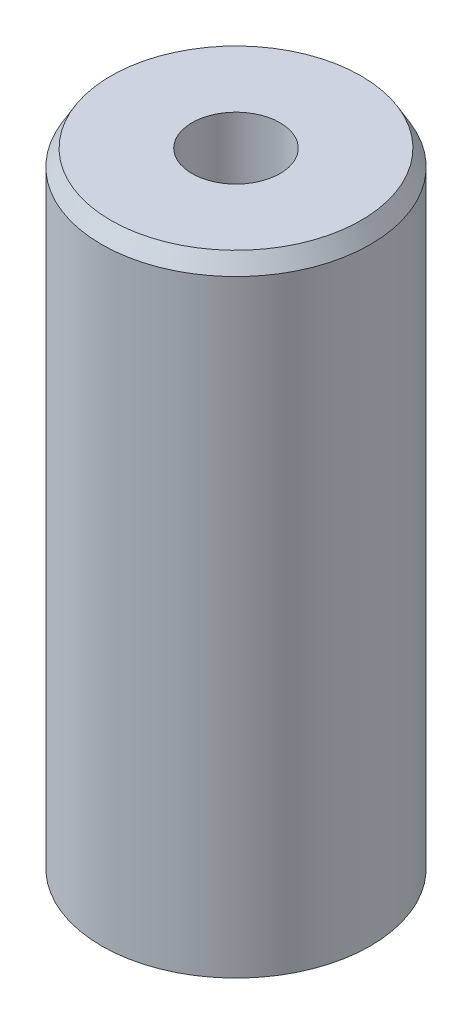
ISO-10303-21;
HEADER;
FILE_DESCRIPTION(('STEP AP214'),'2;1');
FILE_NAME('part.step','',(''),(''),'','','');
FILE_SCHEMA(('AUTOMOTIVE_DESIGN { 1 0 10303 214 1 1 1 1 }'));
ENDSEC;
DATA;
#1=APPLICATION_CONTEXT('core data for automotive mechanical design processes');
#2=APPLICATION_PROTOCOL_DEFINITION('international standard','automotive_design',2000,#1);
#3=PRODUCT_CONTEXT('',#1,'mechanical');
#4=PRODUCT('Part','Part','',(#3));
#5=PRODUCT_RELATED_PRODUCT_CATEGORY('part','',(#4));
#6=PRODUCT_DEFINITION_FORMATION('','',#4);
#7=PRODUCT_DEFINITION_CONTEXT('part definition',#1,'design');
#8=PRODUCT_DEFINITION('design','',#6,#7);
#9=PRODUCT_DEFINITION_SHAPE('','',#8);
#10=(LENGTH_UNIT() NAMED_UNIT(*) SI_UNIT(.MILLI.,.METRE.));
#11=(NAMED_UNIT(*) PLANE_ANGLE_UNIT() SI_UNIT($,.RADIAN.));
#12=(NAMED_UNIT(*) SI_UNIT($,.STERADIAN.) SOLID_ANGLE_UNIT());
#13=UNCERTAINTY_MEASURE_WITH_UNIT(LENGTH_MEASURE(1.E-05),#10,'distance_accuracy_value','');
#14=(GEOMETRIC_REPRESENTATION_CONTEXT(3) GLOBAL_UNCERTAINTY_ASSIGNED_CONTEXT((#13)) GLOBAL_UNIT_ASSIGNED_CONTEXT((#10,
#11,#12)) REPRESENTATION_CONTEXT('',''));
#15=CARTESIAN_POINT('',(0.,0.,0.));
#16=DIRECTION('',(0.,0.,1.));
#17=DIRECTION('',(1.,0.,0.));
#18=AXIS2_PLACEMENT_3D('',#15,#16,#17);
#19=CARTESIAN_POINT('',(0.,35.3084076067197,0.));
#20=DIRECTION('',(0.,-1.,0.));
#21=DIRECTION('',(0.,0.,-1.));
#22=AXIS2_PLACEMENT_3D('',#19,#20,#21);
#23=CYLINDRICAL_SURFACE('',#22,7.5);
#24=CARTESIAN_POINT('',(0.,34.4060671083398,0.));
#25=DIRECTION('',(0.,1.,0.));
#26=DIRECTION('',(0.,0.,1.));
#27=AXIS2_PLACEMENT_3D('',#24,#25,#26);
#28=CIRCLE('',#27,7.5);
#29=CARTESIAN_POINT('',(0.,34.4060671083398,-7.5));
#30=VERTEX_POINT('',#29);
#31=EDGE_CURVE('E50',#30,#30,#28,.F.);
#32=CARTESIAN_POINT('',(0.,0.520966529640357,0.));
#33=DIRECTION('',(0.,1.,0.));
#34=DIRECTION('',(0.,0.,1.));
#35=AXIS2_PLACEMENT_3D('',#32,#33,#34);
#36=CIRCLE('',#35,7.5);
#37=CARTESIAN_POINT('',(0.,0.520966529640357,-7.5));
#38=VERTEX_POINT('',#37);
#39=EDGE_CURVE('E51',#38,#38,#36,.T.);
#40=CARTESIAN_POINT('',(0.,34.4060671083398,-7.5));
#41=CARTESIAN_POINT('',(0.,34.0530973106451,-7.5));
#42=CARTESIAN_POINT('',(0.,33.7001275129503,-7.5));
#43=CARTESIAN_POINT('',(0.,32.9941879175607,-7.5));
#44=CARTESIAN_POINT('',(0.,32.6412181198659,-7.5));
#45=CARTESIAN_POINT('',(0.,31.9352785244763,-7.5));
#46=CARTESIAN_POINT('',(0.,31.5823087267816,-7.5));
#47=CARTESIAN_POINT('',(0.,30.876369131392,-7.5));
#48=CARTESIAN_POINT('',(0.,30.5233993336972,-7.5));
#49=CARTESIAN_POINT('',(0.,29.8174597383076,-7.5));
#50=CARTESIAN_POINT('',(0.,29.4644899406128,-7.5));
#51=CARTESIAN_POINT('',(0.,28.7585503452233,-7.5));
#52=CARTESIAN_POINT('',(0.,28.4055805475285,-7.5));
#53=CARTESIAN_POINT('',(0.,27.6996409521389,-7.5));
#54=CARTESIAN_POINT('',(0.,27.3466711544441,-7.5));
#55=CARTESIAN_POINT('',(0.,26.6407315590545,-7.5));
#56=CARTESIAN_POINT('',(0.,26.2877617613598,-7.5));
#57=CARTESIAN_POINT('',(0.,25.5818221659702,-7.5));
#58=CARTESIAN_POINT('',(0.,25.2288523682754,-7.5));
#59=CARTESIAN_POINT('',(0.,24.5229127728858,-7.5));
#60=CARTESIAN_POINT('',(0.,24.169942975191,-7.5));
#61=CARTESIAN_POINT('',(0.,23.4640033798015,-7.5));
#62=CARTESIAN_POINT('',(0.,23.1110335821067,-7.5));
#63=CARTESIAN_POINT('',(0.,22.4050939867171,-7.5));
#64=CARTESIAN_POINT('',(0.,22.0521241890223,-7.5));
#65=CARTESIAN_POINT('',(0.,21.3461845936328,-7.5));
#66=CARTESIAN_POINT('',(0.,20.993214795938,-7.5));
#67=CARTESIAN_POINT('',(0.,20.2872752005484,-7.5));
#68=CARTESIAN_POINT('',(0.,19.9343054028536,-7.5));
#69=CARTESIAN_POINT('',(0.,19.228365807464,-7.5));
#70=CARTESIAN_POINT('',(0.,18.8753960097693,-7.5));
#71=CARTESIAN_POINT('',(0.,18.1694564143797,-7.5));
#72=CARTESIAN_POINT('',(0.,17.8164866166849,-7.5));
#73=CARTESIAN_POINT('',(0.,17.1105470212953,-7.5));
#74=CARTESIAN_POINT('',(0.,16.7575772236005,-7.5));
#75=CARTESIAN_POINT('',(0.,16.051637628211,-7.5));
#76=CARTESIAN_POINT('',(0.,15.6986678305162,-7.5));
#77=CARTESIAN_POINT('',(0.,14.9927282351266,-7.5));
#78=CARTESIAN_POINT('',(0.,14.6397584374318,-7.5));
#79=CARTESIAN_POINT('',(0.,13.9338188420422,-7.5));
#80=CARTESIAN_POINT('',(0.,13.5808490443475,-7.5));
#81=CARTESIAN_POINT('',(0.,12.8749094489579,-7.5));
#82=CARTESIAN_POINT('',(0.,12.5219396512631,-7.5));
#83=CARTESIAN_POINT('',(0.,11.8160000558735,-7.5));
#84=CARTESIAN_POINT('',(0.,11.4630302581787,-7.5));
#85=CARTESIAN_POINT('',(0.,10.7570906627892,-7.5));
#86=CARTESIAN_POINT('',(0.,10.4041208650944,-7.5));
#87=CARTESIAN_POINT('',(0.,9.6981812697048,-7.5));
#88=CARTESIAN_POINT('',(0.,9.34521147201002,-7.5));
#89=CARTESIAN_POINT('',(0.,8.63927187662044,-7.5));
#90=CARTESIAN_POINT('',(0.,8.28630207892566,-7.5));
#91=CARTESIAN_POINT('',(0.,7.58036248353608,-7.5));
#92=CARTESIAN_POINT('',(0.,7.2273926858413,-7.5));
#93=CARTESIAN_POINT('',(0.,6.52145309045173,-7.5));
#94=CARTESIAN_POINT('',(0.,6.16848329275694,-7.5));
#95=CARTESIAN_POINT('',(0.,5.46254369736737,-7.5));
#96=CARTESIAN_POINT('',(0.,5.10957389967258,-7.5));
#97=CARTESIAN_POINT('',(0.,4.40363430428301,-7.5));
#98=CARTESIAN_POINT('',(0.,4.05066450658822,-7.5));
#99=CARTESIAN_POINT('',(0.,3.34472491119865,-7.5));
#100=CARTESIAN_POINT('',(0.,2.99175511350386,-7.5));
#101=CARTESIAN_POINT('',(0.,2.28581551811429,-7.5));
#102=CARTESIAN_POINT('',(0.,1.9328457204195,-7.5));
#103=CARTESIAN_POINT('',(0.,1.22690612502993,-7.5));
#104=CARTESIAN_POINT('',(0.,0.873936327335144,-7.5));
#105=CARTESIAN_POINT('',(0.,0.520966529640357,-7.5));
#106=B_SPLINE_CURVE_WITH_KNOTS('',3,(#40,#41,#42,#43,#44,#45,#46,#47,#48,#49,#50,#51,#52,#53,
#54,#55,#56,#57,#58,#59,#60,#61,#62,#63,#64,#65,#66,#67,#68,#69,#70,#71,#72,#73,#74,#75,#76,#77,
#78,#79,#80,#81,#82,#83,#84,#85,#86,#87,#88,#89,#90,#91,#92,#93,#94,#95,#96,#97,#98,#99,#100,
#101,#102,#103,#104,#105),.UNSPECIFIED.,.F.,.F.,(4,2,2,2,2,2,2,2,2,2,2,2,2,2,2,2,2,2,2,2,2,2,2,
2,2,2,2,2,2,2,2,2,4),(0.,1.05890939308435,2.11781878616871,3.17672817925307,4.23563757233743,
5.29454696542179,6.35345635850615,7.41236575159051,8.47127514467487,9.53018453775923,
10.5890939308436,11.6480033239279,12.7069127170123,13.7658221100967,14.824731503181,
15.8836408962654,16.9425502893497,18.0014596824341,19.0603690755185,20.1192784686028,
21.1781878616872,22.2370972547715,23.2960066478559,24.3549160409403,25.4138254340246,
26.472734827109,27.5316442201933,28.5905536132777,29.6494630063621,30.7083723994464,
31.7672817925308,32.8261911856151,33.8851005786995),.UNSPECIFIED.);
#107=EDGE_CURVE('BSEAM39',#30,#38,#106,.T.);
#108=ORIENTED_EDGE('',*,*,#31,.T.);
#109=ORIENTED_EDGE('',*,*,#39,.T.);
#110=ORIENTED_EDGE('',*,*,#107,.T.);
#111=ORIENTED_EDGE('',*,*,#107,.F.);
#112=EDGE_LOOP('',(#108,#110,#109,#111));
#113=FACE_BOUND('',#112,.T.);
#114=ADVANCED_FACE('F39',(#113),#23,.T.);
#115=CARTESIAN_POINT('',(0.,35.3084076067197,0.));
#116=DIRECTION('',(0.,1.,0.));
#117=DIRECTION('',(0.,0.,1.));
#118=AXIS2_PLACEMENT_3D('',#115,#116,#117);
#119=PLANE('',#118);
#120=CARTESIAN_POINT('',(0.,35.3084076067197,0.));
#121=DIRECTION('',(0.,1.,0.));
#122=DIRECTION('',(0.,0.,1.));
#123=AXIS2_PLACEMENT_3D('',#120,#121,#122);
#124=CIRCLE('',#123,6.97903347035967);
#125=CARTESIAN_POINT('',(0.,35.3084076067197,6.97903347035967));
#126=VERTEX_POINT('',#125);
#127=EDGE_CURVE('E54',#126,#126,#124,.T.);
#128=ORIENTED_EDGE('',*,*,#127,.T.);
#129=EDGE_LOOP('',(#128));
#130=FACE_BOUND('',#129,.T.);
#131=CARTESIAN_POINT('',(0.,35.3084076067197,0.));
#132=DIRECTION('',(0.,1.,0.));
#133=DIRECTION('',(0.,0.,1.));
#134=AXIS2_PLACEMENT_3D('',#131,#132,#133);
#135=CIRCLE('',#134,2.4576226990207);
#136=CARTESIAN_POINT('',(0.,35.3084076067197,-2.4576226990207));
#137=VERTEX_POINT('',#136);
#138=EDGE_CURVE('E58',#137,#137,#135,.T.);
#139=ORIENTED_EDGE('',*,*,#138,.F.);
#140=EDGE_LOOP('',(#139));
#141=FACE_BOUND('',#140,.T.);
#142=ADVANCED_FACE('F69',(#130,#141),#119,.T.);
#143=CARTESIAN_POINT('',(0.,0.,0.));
#144=DIRECTION('',(0.,1.,0.));
#145=DIRECTION('',(0.,0.,1.));
#146=AXIS2_PLACEMENT_3D('',#143,#144,#145);
#147=PLANE('',#146);
#148=CARTESIAN_POINT('',(0.,0.,0.));
#149=DIRECTION('',(0.,1.,0.));
#150=DIRECTION('',(0.,0.,1.));
#151=AXIS2_PLACEMENT_3D('',#148,#149,#150);
#152=CIRCLE('',#151,6.59765950162005);
#153=CARTESIAN_POINT('',(0.,0.,6.59765950162005));
#154=VERTEX_POINT('',#153);
#155=EDGE_CURVE('E10',#154,#154,#152,.F.);
#156=ORIENTED_EDGE('',*,*,#155,.T.);
#157=EDGE_LOOP('',(#156));
#158=FACE_BOUND('',#157,.T.);
#159=CARTESIAN_POINT('',(0.,0.,0.));
#160=DIRECTION('',(0.,1.,0.));
#161=DIRECTION('',(0.,0.,1.));
#162=AXIS2_PLACEMENT_3D('',#159,#160,#161);
#163=CIRCLE('',#162,2.4576226990207);
#164=CARTESIAN_POINT('',(0.,0.,-2.4576226990207));
#165=VERTEX_POINT('',#164);
#166=EDGE_CURVE('E63',#165,#165,#163,.T.);
#167=ORIENTED_EDGE('',*,*,#166,.T.);
#168=EDGE_LOOP('',(#167));
#169=FACE_BOUND('',#168,.T.);
#170=ADVANCED_FACE('F75',(#158,#169),#147,.F.);
#171=CARTESIAN_POINT('',(0.,35.3084076067197,0.));
#172=DIRECTION('',(0.,-1.,0.));
#173=DIRECTION('',(0.,0.,-1.));
#174=AXIS2_PLACEMENT_3D('',#171,#172,#173);
#175=CYLINDRICAL_SURFACE('',#174,2.4576226990207);
#176=CARTESIAN_POINT('',(0.,35.3084076067197,-2.4576226990207));
#177=CARTESIAN_POINT('',(0.,34.9406116941497,-2.4576226990207));
#178=CARTESIAN_POINT('',(0.,34.5728157815797,-2.4576226990207));
#179=CARTESIAN_POINT('',(0.,33.8372239564397,-2.4576226990207));
#180=CARTESIAN_POINT('',(0.,33.4694280438697,-2.4576226990207));
#181=CARTESIAN_POINT('',(0.,32.7338362187297,-2.4576226990207));
#182=CARTESIAN_POINT('',(0.,32.3660403061598,-2.4576226990207));
#183=CARTESIAN_POINT('',(0.,31.6304484810198,-2.4576226990207));
#184=CARTESIAN_POINT('',(0.,31.2626525684498,-2.4576226990207));
#185=CARTESIAN_POINT('',(0.,30.5270607433098,-2.4576226990207));
#186=CARTESIAN_POINT('',(0.,30.1592648307398,-2.4576226990207));
#187=CARTESIAN_POINT('',(0.,29.4236730055998,-2.4576226990207));
#188=CARTESIAN_POINT('',(0.,29.0558770930298,-2.4576226990207));
#189=CARTESIAN_POINT('',(0.,28.3202852678898,-2.4576226990207));
#190=CARTESIAN_POINT('',(0.,27.9524893553198,-2.4576226990207));
#191=CARTESIAN_POINT('',(0.,27.2168975301798,-2.4576226990207));
#192=CARTESIAN_POINT('',(0.,26.8491016176098,-2.4576226990207));
#193=CARTESIAN_POINT('',(0.,26.1135097924698,-2.4576226990207));
#194=CARTESIAN_POINT('',(0.,25.7457138798998,-2.4576226990207));
#195=CARTESIAN_POINT('',(0.,25.0101220547598,-2.4576226990207));
#196=CARTESIAN_POINT('',(0.,24.6423261421898,-2.4576226990207));
#197=CARTESIAN_POINT('',(0.,23.9067343170498,-2.4576226990207));
#198=CARTESIAN_POINT('',(0.,23.5389384044798,-2.4576226990207));
#199=CARTESIAN_POINT('',(0.,22.8033465793398,-2.4576226990207));
#200=CARTESIAN_POINT('',(0.,22.4355506667698,-2.4576226990207));
#201=CARTESIAN_POINT('',(0.,21.6999588416298,-2.4576226990207));
#202=CARTESIAN_POINT('',(0.,21.3321629290598,-2.4576226990207));
#203=CARTESIAN_POINT('',(0.,20.5965711039198,-2.4576226990207));
#204=CARTESIAN_POINT('',(0.,20.2287751913498,-2.4576226990207));
#205=CARTESIAN_POINT('',(0.,19.4931833662099,-2.4576226990207));
#206=CARTESIAN_POINT('',(0.,19.1253874536399,-2.4576226990207));
#207=CARTESIAN_POINT('',(0.,18.3897956284999,-2.4576226990207));
#208=CARTESIAN_POINT('',(0.,18.0219997159299,-2.4576226990207));
#209=CARTESIAN_POINT('',(0.,17.2864078907899,-2.4576226990207));
#210=CARTESIAN_POINT('',(0.,16.9186119782199,-2.4576226990207));
#211=CARTESIAN_POINT('',(0.,16.1830201530799,-2.4576226990207));
#212=CARTESIAN_POINT('',(0.,15.8152242405099,-2.4576226990207));
#213=CARTESIAN_POINT('',(0.,15.0796324153699,-2.4576226990207));
#214=CARTESIAN_POINT('',(0.,14.7118365027999,-2.4576226990207));
#215=CARTESIAN_POINT('',(0.,13.9762446776599,-2.4576226990207));
#216=CARTESIAN_POINT('',(0.,13.6084487650899,-2.4576226990207));
#217=CARTESIAN_POINT('',(0.,12.8728569399499,-2.4576226990207));
#218=CARTESIAN_POINT('',(0.,12.5050610273799,-2.4576226990207));
#219=CARTESIAN_POINT('',(0.,11.7694692022399,-2.4576226990207));
#220=CARTESIAN_POINT('',(0.,11.4016732896699,-2.4576226990207));
#221=CARTESIAN_POINT('',(0.,10.6660814645299,-2.4576226990207));
#222=CARTESIAN_POINT('',(0.,10.2982855519599,-2.4576226990207));
#223=CARTESIAN_POINT('',(0.,9.56269372681993,-2.4576226990207));
#224=CARTESIAN_POINT('',(0.,9.19489781424993,-2.4576226990207));
#225=CARTESIAN_POINT('',(0.,8.45930598910994,-2.4576226990207));
#226=CARTESIAN_POINT('',(0.,8.09151007653994,-2.4576226990207));
#227=CARTESIAN_POINT('',(0.,7.35591825139994,-2.4576226990207));
#228=CARTESIAN_POINT('',(0.,6.98812233882995,-2.4576226990207));
#229=CARTESIAN_POINT('',(0.,6.25253051368995,-2.4576226990207));
#230=CARTESIAN_POINT('',(0.,5.88473460111996,-2.4576226990207));
#231=CARTESIAN_POINT('',(0.,5.14914277597996,-2.4576226990207));
#232=CARTESIAN_POINT('',(0.,4.78134686340996,-2.4576226990207));
#233=CARTESIAN_POINT('',(0.,4.04575503826997,-2.4576226990207));
#234=CARTESIAN_POINT('',(0.,3.67795912569997,-2.4576226990207));
#235=CARTESIAN_POINT('',(0.,2.94236730055998,-2.4576226990207));
#236=CARTESIAN_POINT('',(0.,2.57457138798998,-2.4576226990207));
#237=CARTESIAN_POINT('',(0.,1.83897956284999,-2.4576226990207));
#238=CARTESIAN_POINT('',(0.,1.47118365027999,-2.4576226990207));
#239=CARTESIAN_POINT('',(0.,0.735591825139997,-2.4576226990207));
#240=CARTESIAN_POINT('',(0.,0.367795912569999,-2.4576226990207));
#241=CARTESIAN_POINT('',(0.,0.,-2.4576226990207));
#242=B_SPLINE_CURVE_WITH_KNOTS('',3,(#176,#177,#178,#179,#180,#181,#182,#183,#184,#185,#186,
#187,#188,#189,#190,#191,#192,#193,#194,#195,#196,#197,#198,#199,#200,#201,#202,#203,#204,#205,
#206,#207,#208,#209,#210,#211,#212,#213,#214,#215,#216,#217,#218,#219,#220,#221,#222,#223,#224,
#225,#226,#227,#228,#229,#230,#231,#232,#233,#234,#235,#236,#237,#238,#239,#240,#241),
.UNSPECIFIED.,.F.,.F.,(4,2,2,2,2,2,2,2,2,2,2,2,2,2,2,2,2,2,2,2,2,2,2,2,2,2,2,2,2,2,2,2,4),(0.,
1.10338773770999,2.20677547541998,3.31016321312997,4.41355095083996,5.51693868854996,
6.62032642625995,7.72371416396994,8.82710190167993,9.93048963938992,11.0338773770999,
12.1372651148099,13.2406528525199,14.3440405902299,15.4474283279399,16.5508160656499,
17.6542038033599,18.7575915410699,19.8609792787798,20.9643670164898,22.0677547541998,
23.1711424919098,24.2745302296198,25.3779179673298,26.4813057050398,27.5846934427498,
28.6880811804598,29.7914689181698,30.8948566558798,31.9982443935898,33.1016321312997,
34.2050198690097,35.3084076067197),.UNSPECIFIED.);
#243=EDGE_CURVE('BSEAM70',#137,#165,#242,.T.);
#244=ORIENTED_EDGE('',*,*,#138,.T.);
#245=ORIENTED_EDGE('',*,*,#166,.F.);
#246=ORIENTED_EDGE('',*,*,#243,.T.);
#247=ORIENTED_EDGE('',*,*,#243,.F.);
#248=EDGE_LOOP('',(#244,#246,#245,#247));
#249=FACE_BOUND('',#248,.T.);
#250=ADVANCED_FACE('F70',(#249),#175,.F.);
#251=CARTESIAN_POINT('',(0.,35.3084076067197,0.));
#252=DIRECTION('',(0.,-1.,0.));
#253=DIRECTION('',(0.,0.,-1.));
#254=AXIS2_PLACEMENT_3D('',#251,#252,#253);
#255=CONICAL_SURFACE('',#254,6.97903347035967,0.523598775598297);
#256=ORIENTED_EDGE('',*,*,#31,.F.);
#257=EDGE_LOOP('',(#256));
#258=FACE_BOUND('',#257,.T.);
#259=ORIENTED_EDGE('',*,*,#127,.F.);
#260=EDGE_LOOP('',(#259));
#261=FACE_BOUND('',#260,.T.);
#262=ADVANCED_FACE('F81',(#258,#261),#255,.T.);
#263=CARTESIAN_POINT('',(0.,0.520966529640357,0.));
#264=DIRECTION('',(0.,1.,0.));
#265=DIRECTION('',(0.,0.,1.));
#266=AXIS2_PLACEMENT_3D('',#263,#264,#265);
#267=CONICAL_SURFACE('',#266,7.5,1.04719755119661);
#268=ORIENTED_EDGE('',*,*,#155,.F.);
#269=EDGE_LOOP('',(#268));
#270=FACE_BOUND('',#269,.T.);
#271=ORIENTED_EDGE('',*,*,#39,.F.);
#272=EDGE_LOOP('',(#271));
#273=FACE_BOUND('',#272,.T.);
#274=ADVANCED_FACE('F45',(#270,#273),#267,.T.);
#275=CLOSED_SHELL('',(#114,#142,#170,#250,#262,#274));
#276=MANIFOLD_SOLID_BREP('B2',#275);
#277=ADVANCED_BREP_SHAPE_REPRESENTATION('',(#18,#276),#14);
#278=SHAPE_DEFINITION_REPRESENTATION(#9,#277);
ENDSEC;
END-ISO-10303-21;
